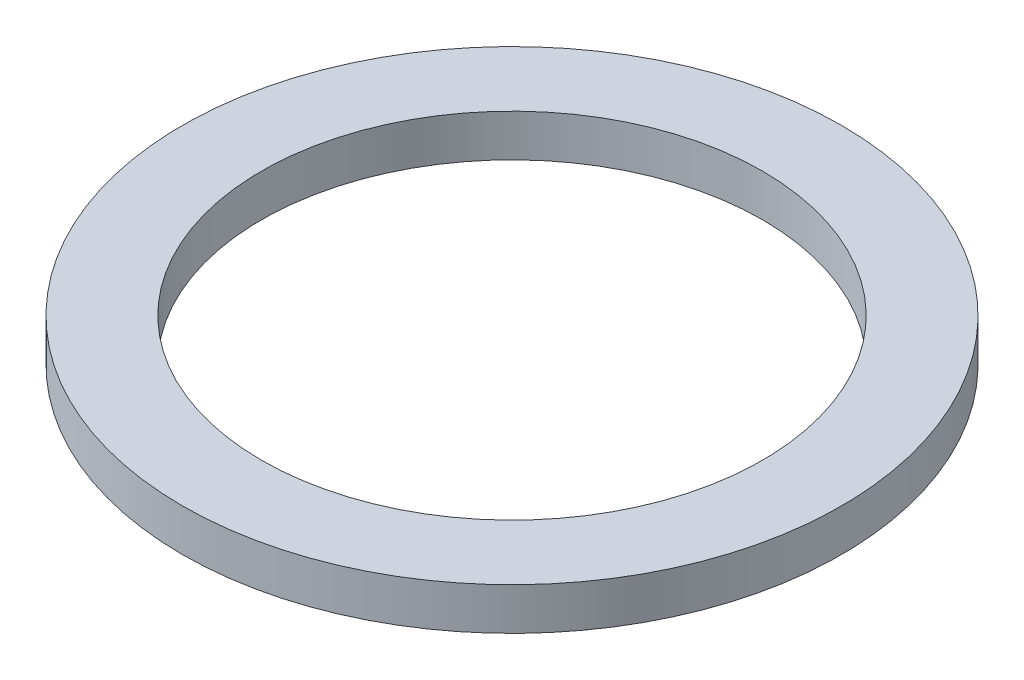
ISO-10303-21;
HEADER;
FILE_DESCRIPTION(('STEP AP214'),'2;1');
FILE_NAME('part.step','',(''),(''),'','','');
FILE_SCHEMA(('AUTOMOTIVE_DESIGN { 1 0 10303 214 1 1 1 1 }'));
ENDSEC;
DATA;
#1=APPLICATION_CONTEXT('core data for automotive mechanical design processes');
#2=APPLICATION_PROTOCOL_DEFINITION('international standard','automotive_design',2000,#1);
#3=PRODUCT_CONTEXT('',#1,'mechanical');
#4=PRODUCT('Part','Part','',(#3));
#5=PRODUCT_RELATED_PRODUCT_CATEGORY('part','',(#4));
#6=PRODUCT_DEFINITION_FORMATION('','',#4);
#7=PRODUCT_DEFINITION_CONTEXT('part definition',#1,'design');
#8=PRODUCT_DEFINITION('design','',#6,#7);
#9=PRODUCT_DEFINITION_SHAPE('','',#8);
#10=(LENGTH_UNIT() NAMED_UNIT(*) SI_UNIT(.MILLI.,.METRE.));
#11=(NAMED_UNIT(*) PLANE_ANGLE_UNIT() SI_UNIT($,.RADIAN.));
#12=(NAMED_UNIT(*) SI_UNIT($,.STERADIAN.) SOLID_ANGLE_UNIT());
#13=UNCERTAINTY_MEASURE_WITH_UNIT(LENGTH_MEASURE(1.E-05),#10,'distance_accuracy_value','');
#14=(GEOMETRIC_REPRESENTATION_CONTEXT(3) GLOBAL_UNCERTAINTY_ASSIGNED_CONTEXT((#13)) GLOBAL_UNIT_ASSIGNED_CONTEXT((#10,
#11,#12)) REPRESENTATION_CONTEXT('',''));
#15=CARTESIAN_POINT('',(0.,0.,0.));
#16=DIRECTION('',(0.,0.,1.));
#17=DIRECTION('',(1.,0.,0.));
#18=AXIS2_PLACEMENT_3D('',#15,#16,#17);
#19=CARTESIAN_POINT('',(0.,8.,0.));
#20=DIRECTION('',(0.,-1.,0.));
#21=DIRECTION('',(0.,0.,-1.));
#22=AXIS2_PLACEMENT_3D('',#19,#20,#21);
#23=CYLINDRICAL_SURFACE('',#22,62.5);
#24=CARTESIAN_POINT('',(0.,8.,0.));
#25=DIRECTION('',(0.,1.,0.));
#26=DIRECTION('',(0.,0.,1.));
#27=AXIS2_PLACEMENT_3D('',#24,#25,#26);
#28=CIRCLE('',#27,62.5);
#29=CARTESIAN_POINT('',(0.,8.,62.5));
#30=VERTEX_POINT('',#29);
#31=EDGE_CURVE('E10',#30,#30,#28,.T.);
#32=ORIENTED_EDGE('',*,*,#31,.F.);
#33=EDGE_LOOP('',(#32));
#34=FACE_BOUND('',#33,.T.);
#35=CARTESIAN_POINT('',(0.,0.,0.));
#36=DIRECTION('',(0.,1.,0.));
#37=DIRECTION('',(0.,0.,1.));
#38=AXIS2_PLACEMENT_3D('',#35,#36,#37);
#39=CIRCLE('',#38,62.5);
#40=CARTESIAN_POINT('',(0.,0.,62.5));
#41=VERTEX_POINT('',#40);
#42=EDGE_CURVE('E37',#41,#41,#39,.T.);
#43=ORIENTED_EDGE('',*,*,#42,.T.);
#44=EDGE_LOOP('',(#43));
#45=FACE_BOUND('',#44,.T.);
#46=ADVANCED_FACE('F40',(#34,#45),#23,.T.);
#47=CARTESIAN_POINT('',(0.,8.,0.));
#48=DIRECTION('',(0.,1.,0.));
#49=DIRECTION('',(0.,0.,1.));
#50=AXIS2_PLACEMENT_3D('',#47,#48,#49);
#51=PLANE('',#50);
#52=CARTESIAN_POINT('',(0.,8.,0.));
#53=DIRECTION('',(0.,1.,0.));
#54=DIRECTION('',(0.,0.,1.));
#55=AXIS2_PLACEMENT_3D('',#52,#53,#54);
#56=CIRCLE('',#55,47.5);
#57=CARTESIAN_POINT('',(0.,8.,47.5));
#58=VERTEX_POINT('',#57);
#59=EDGE_CURVE('E50',#58,#58,#56,.T.);
#60=ORIENTED_EDGE('',*,*,#59,.F.);
#61=EDGE_LOOP('',(#60));
#62=FACE_BOUND('',#61,.T.);
#63=ORIENTED_EDGE('',*,*,#31,.T.);
#64=EDGE_LOOP('',(#63));
#65=FACE_BOUND('',#64,.T.);
#66=ADVANCED_FACE('F59',(#62,#65),#51,.T.);
#67=CARTESIAN_POINT('',(0.,0.,0.));
#68=DIRECTION('',(0.,1.,0.));
#69=DIRECTION('',(0.,0.,1.));
#70=AXIS2_PLACEMENT_3D('',#67,#68,#69);
#71=PLANE('',#70);
#72=CARTESIAN_POINT('',(0.,0.,0.));
#73=DIRECTION('',(0.,1.,0.));
#74=DIRECTION('',(0.,0.,1.));
#75=AXIS2_PLACEMENT_3D('',#72,#73,#74);
#76=CIRCLE('',#75,47.5);
#77=CARTESIAN_POINT('',(0.,0.,47.5));
#78=VERTEX_POINT('',#77);
#79=EDGE_CURVE('E47',#78,#78,#76,.T.);
#80=ORIENTED_EDGE('',*,*,#79,.T.);
#81=EDGE_LOOP('',(#80));
#82=FACE_BOUND('',#81,.T.);
#83=ORIENTED_EDGE('',*,*,#42,.F.);
#84=EDGE_LOOP('',(#83));
#85=FACE_BOUND('',#84,.T.);
#86=ADVANCED_FACE('F58',(#82,#85),#71,.F.);
#87=CARTESIAN_POINT('',(0.,8.,0.));
#88=DIRECTION('',(0.,-1.,0.));
#89=DIRECTION('',(0.,0.,-1.));
#90=AXIS2_PLACEMENT_3D('',#87,#88,#89);
#91=CYLINDRICAL_SURFACE('',#90,47.5);
#92=ORIENTED_EDGE('',*,*,#59,.T.);
#93=EDGE_LOOP('',(#92));
#94=FACE_BOUND('',#93,.T.);
#95=ORIENTED_EDGE('',*,*,#79,.F.);
#96=EDGE_LOOP('',(#95));
#97=FACE_BOUND('',#96,.T.);
#98=ADVANCED_FACE('F54',(#94,#97),#91,.F.);
#99=CLOSED_SHELL('',(#46,#66,#86,#98));
#100=MANIFOLD_SOLID_BREP('B2',#99);
#101=ADVANCED_BREP_SHAPE_REPRESENTATION('',(#18,#100),#14);
#102=SHAPE_DEFINITION_REPRESENTATION(#9,#101);
ENDSEC;
END-ISO-10303-21;
